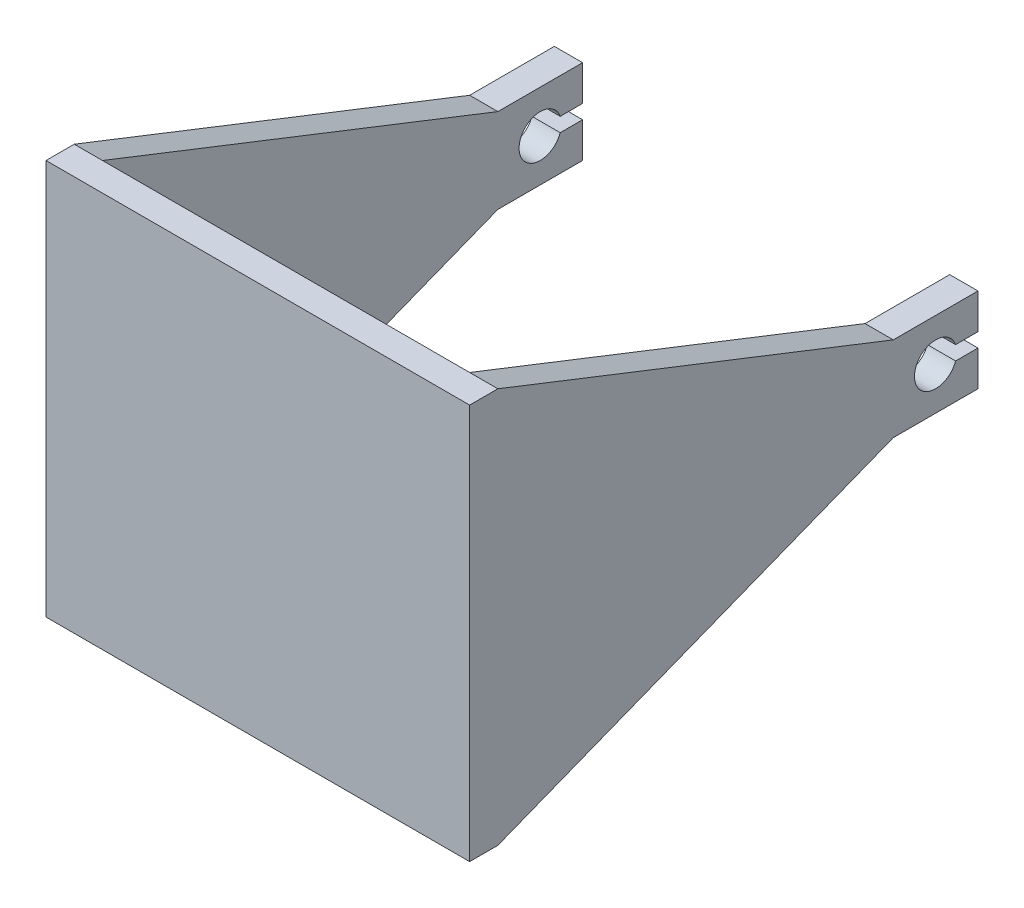
ISO-10303-21;
HEADER;
FILE_DESCRIPTION(('STEP AP214'),'2;1');
FILE_NAME('part.step','',(''),(''),'','','');
FILE_SCHEMA(('AUTOMOTIVE_DESIGN { 1 0 10303 214 1 1 1 1 }'));
ENDSEC;
DATA;
#1=APPLICATION_CONTEXT('core data for automotive mechanical design processes');
#2=APPLICATION_PROTOCOL_DEFINITION('international standard','automotive_design',2000,#1);
#3=PRODUCT_CONTEXT('',#1,'mechanical');
#4=PRODUCT('Part','Part','',(#3));
#5=PRODUCT_RELATED_PRODUCT_CATEGORY('part','',(#4));
#6=PRODUCT_DEFINITION_FORMATION('','',#4);
#7=PRODUCT_DEFINITION_CONTEXT('part definition',#1,'design');
#8=PRODUCT_DEFINITION('design','',#6,#7);
#9=PRODUCT_DEFINITION_SHAPE('','',#8);
#10=(LENGTH_UNIT() NAMED_UNIT(*) SI_UNIT(.MILLI.,.METRE.));
#11=(NAMED_UNIT(*) PLANE_ANGLE_UNIT() SI_UNIT($,.RADIAN.));
#12=(NAMED_UNIT(*) SI_UNIT($,.STERADIAN.) SOLID_ANGLE_UNIT());
#13=UNCERTAINTY_MEASURE_WITH_UNIT(LENGTH_MEASURE(1.E-05),#10,'distance_accuracy_value','');
#14=(GEOMETRIC_REPRESENTATION_CONTEXT(3) GLOBAL_UNCERTAINTY_ASSIGNED_CONTEXT((#13)) GLOBAL_UNIT_ASSIGNED_CONTEXT((#10,
#11,#12)) REPRESENTATION_CONTEXT('',''));
#15=CARTESIAN_POINT('',(0.,0.,0.));
#16=DIRECTION('',(0.,0.,1.));
#17=DIRECTION('',(1.,0.,0.));
#18=AXIS2_PLACEMENT_3D('',#15,#16,#17);
#19=CARTESIAN_POINT('',(0.,0.,150.));
#20=DIRECTION('',(0.,0.,1.));
#21=DIRECTION('',(1.,0.,0.));
#22=AXIS2_PLACEMENT_3D('',#19,#20,#21);
#23=PLANE('',#22);
#24=DIRECTION('',(-1.,0.,0.));
#25=VECTOR('',#24,1.);
#26=CARTESIAN_POINT('',(75.,70.,150.));
#27=LINE('',#26,#25);
#28=CARTESIAN_POINT('',(75.,70.,150.));
#29=VERTEX_POINT('',#28);
#30=CARTESIAN_POINT('',(-75.,70.,150.));
#31=VERTEX_POINT('',#30);
#32=EDGE_CURVE('E125',#29,#31,#27,.T.);
#33=ORIENTED_EDGE('',*,*,#32,.T.);
#34=DIRECTION('',(0.,1.,0.));
#35=VECTOR('',#34,1.);
#36=CARTESIAN_POINT('',(-75.,-70.,150.));
#37=LINE('',#36,#35);
#38=CARTESIAN_POINT('',(-75.,-70.,150.));
#39=VERTEX_POINT('',#38);
#40=EDGE_CURVE('E135',#39,#31,#37,.T.);
#41=ORIENTED_EDGE('',*,*,#40,.F.);
#42=DIRECTION('',(1.,0.,0.));
#43=VECTOR('',#42,1.);
#44=CARTESIAN_POINT('',(75.,-70.,150.));
#45=LINE('',#44,#43);
#46=CARTESIAN_POINT('',(75.,-70.,150.));
#47=VERTEX_POINT('',#46);
#48=EDGE_CURVE('E129',#39,#47,#45,.T.);
#49=ORIENTED_EDGE('',*,*,#48,.T.);
#50=DIRECTION('',(0.,1.,0.));
#51=VECTOR('',#50,1.);
#52=CARTESIAN_POINT('',(75.,-70.,150.));
#53=LINE('',#52,#51);
#54=EDGE_CURVE('E128',#47,#29,#53,.T.);
#55=ORIENTED_EDGE('',*,*,#54,.T.);
#56=EDGE_LOOP('',(#33,#41,#49,#55));
#57=FACE_BOUND('',#56,.T.);
#58=ADVANCED_FACE('F41',(#57),#23,.T.);
#59=CARTESIAN_POINT('',(75.,-70.,150.));
#60=DIRECTION('',(0.,1.,0.));
#61=DIRECTION('',(0.,0.,1.));
#62=AXIS2_PLACEMENT_3D('',#59,#60,#61);
#63=PLANE('',#62);
#64=DIRECTION('',(0.,0.,1.));
#65=VECTOR('',#64,1.);
#66=CARTESIAN_POINT('',(-75.,-70.,150.));
#67=LINE('',#66,#65);
#68=CARTESIAN_POINT('',(-75.,-70.,140.));
#69=VERTEX_POINT('',#68);
#70=EDGE_CURVE('E44',#69,#39,#67,.T.);
#71=ORIENTED_EDGE('',*,*,#70,.F.);
#72=DIRECTION('',(-1.,0.,0.));
#73=VECTOR('',#72,1.);
#74=CARTESIAN_POINT('',(225.416089564913,-70.,140.));
#75=LINE('',#74,#73);
#76=CARTESIAN_POINT('',(-65.,-70.,140.));
#77=VERTEX_POINT('',#76);
#78=EDGE_CURVE('E323',#77,#69,#75,.T.);
#79=ORIENTED_EDGE('',*,*,#78,.F.);
#80=DIRECTION('',(-1.,0.,0.));
#81=VECTOR('',#80,1.);
#82=CARTESIAN_POINT('',(215.356688476182,-70.,140.));
#83=LINE('',#82,#81);
#84=CARTESIAN_POINT('',(65.,-70.,140.));
#85=VERTEX_POINT('',#84);
#86=EDGE_CURVE('E141',#85,#77,#83,.T.);
#87=ORIENTED_EDGE('',*,*,#86,.F.);
#88=CARTESIAN_POINT('',(75.,-70.,140.));
#89=VERTEX_POINT('',#88);
#90=EDGE_CURVE('E326',#89,#85,#75,.T.);
#91=ORIENTED_EDGE('',*,*,#90,.F.);
#92=DIRECTION('',(0.,0.,-1.));
#93=VECTOR('',#92,1.);
#94=CARTESIAN_POINT('',(75.,-70.,150.));
#95=LINE('',#94,#93);
#96=EDGE_CURVE('E118',#47,#89,#95,.T.);
#97=ORIENTED_EDGE('',*,*,#96,.F.);
#98=ORIENTED_EDGE('',*,*,#48,.F.);
#99=EDGE_LOOP('',(#71,#79,#87,#91,#97,#98));
#100=FACE_BOUND('',#99,.T.);
#101=ADVANCED_FACE('F359',(#100),#63,.F.);
#102=CARTESIAN_POINT('',(75.,70.,150.));
#103=DIRECTION('',(0.,-1.,0.));
#104=DIRECTION('',(1.,0.,0.));
#105=AXIS2_PLACEMENT_3D('',#102,#103,#104);
#106=PLANE('',#105);
#107=DIRECTION('',(0.,0.,-1.));
#108=VECTOR('',#107,1.);
#109=CARTESIAN_POINT('',(75.,70.,150.));
#110=LINE('',#109,#108);
#111=CARTESIAN_POINT('',(75.,70.,140.));
#112=VERTEX_POINT('',#111);
#113=EDGE_CURVE('E115',#29,#112,#110,.T.);
#114=ORIENTED_EDGE('',*,*,#113,.T.);
#115=DIRECTION('',(-1.,0.,0.));
#116=VECTOR('',#115,1.);
#117=CARTESIAN_POINT('',(225.416089564913,70.,140.));
#118=LINE('',#117,#116);
#119=CARTESIAN_POINT('',(65.,70.,140.));
#120=VERTEX_POINT('',#119);
#121=EDGE_CURVE('E334',#112,#120,#118,.T.);
#122=ORIENTED_EDGE('',*,*,#121,.T.);
#123=DIRECTION('',(-1.,0.,0.));
#124=VECTOR('',#123,1.);
#125=CARTESIAN_POINT('',(215.356688476182,70.,140.));
#126=LINE('',#125,#124);
#127=CARTESIAN_POINT('',(-65.,70.,140.));
#128=VERTEX_POINT('',#127);
#129=EDGE_CURVE('E144',#120,#128,#126,.T.);
#130=ORIENTED_EDGE('',*,*,#129,.T.);
#131=CARTESIAN_POINT('',(-75.,70.,140.));
#132=VERTEX_POINT('',#131);
#133=EDGE_CURVE('E336',#128,#132,#118,.T.);
#134=ORIENTED_EDGE('',*,*,#133,.T.);
#135=DIRECTION('',(0.,0.,-1.));
#136=VECTOR('',#135,1.);
#137=CARTESIAN_POINT('',(-75.,70.,150.));
#138=LINE('',#137,#136);
#139=EDGE_CURVE('E132',#31,#132,#138,.T.);
#140=ORIENTED_EDGE('',*,*,#139,.F.);
#141=ORIENTED_EDGE('',*,*,#32,.F.);
#142=EDGE_LOOP('',(#114,#122,#130,#134,#140,#141));
#143=FACE_BOUND('',#142,.T.);
#144=ADVANCED_FACE('F370',(#143),#106,.F.);
#145=CARTESIAN_POINT('',(65.,-60.,150.));
#146=DIRECTION('',(-1.,0.,0.));
#147=DIRECTION('',(0.,0.,1.));
#148=AXIS2_PLACEMENT_3D('',#145,#146,#147);
#149=PLANE('',#148);
#150=DIRECTION('',(0.,0.365652372422994,-0.930751493440347));
#151=VECTOR('',#150,1.);
#152=CARTESIAN_POINT('',(65.,-72.0662983425414,145.259668508287));
#153=LINE('',#152,#151);
#154=CARTESIAN_POINT('',(65.,-15.,0.));
#155=VERTEX_POINT('',#154);
#156=EDGE_CURVE('E348',#85,#155,#153,.T.);
#157=ORIENTED_EDGE('',*,*,#156,.F.);
#158=DIRECTION('',(0.,-1.,0.));
#159=VECTOR('',#158,1.);
#160=CARTESIAN_POINT('',(65.,-60.,140.));
#161=LINE('',#160,#159);
#162=EDGE_CURVE('E131',#120,#85,#161,.T.);
#163=ORIENTED_EDGE('',*,*,#162,.F.);
#164=DIRECTION('',(0.,0.365652372422994,0.930751493440347));
#165=VECTOR('',#164,1.);
#166=CARTESIAN_POINT('',(65.,56.0220994475138,104.419889502762));
#167=LINE('',#166,#165);
#168=CARTESIAN_POINT('',(65.,15.,0.));
#169=VERTEX_POINT('',#168);
#170=EDGE_CURVE('E309',#169,#120,#167,.T.);
#171=ORIENTED_EDGE('',*,*,#170,.F.);
#172=DIRECTION('',(0.,0.,-1.));
#173=VECTOR('',#172,1.);
#174=CARTESIAN_POINT('',(65.,15.,0.));
#175=LINE('',#174,#173);
#176=CARTESIAN_POINT('',(65.,15.,-30.));
#177=VERTEX_POINT('',#176);
#178=EDGE_CURVE('E149',#169,#177,#175,.T.);
#179=ORIENTED_EDGE('',*,*,#178,.T.);
#180=DIRECTION('',(0.,-1.,0.));
#181=VECTOR('',#180,1.);
#182=CARTESIAN_POINT('',(65.,0.,-30.));
#183=LINE('',#182,#181);
#184=CARTESIAN_POINT('',(65.,2.5,-30.));
#185=VERTEX_POINT('',#184);
#186=EDGE_CURVE('E169',#177,#185,#183,.T.);
#187=ORIENTED_EDGE('',*,*,#186,.T.);
#188=DIRECTION('',(0.,0.,-1.));
#189=VECTOR('',#188,1.);
#190=CARTESIAN_POINT('',(65.,2.5,0.));
#191=LINE('',#190,#189);
#192=CARTESIAN_POINT('',(65.,2.5,-22.0710678118655));
#193=VERTEX_POINT('',#192);
#194=EDGE_CURVE('E157',#193,#185,#191,.T.);
#195=ORIENTED_EDGE('',*,*,#194,.F.);
#196=CARTESIAN_POINT('',(65.,0.,-15.));
#197=DIRECTION('',(-1.,0.,0.));
#198=DIRECTION('',(0.,0.,1.));
#199=AXIS2_PLACEMENT_3D('',#196,#197,#198);
#200=CIRCLE('',#199,7.5);
#201=CARTESIAN_POINT('',(65.,-2.5,-22.0710678118655));
#202=VERTEX_POINT('',#201);
#203=EDGE_CURVE('E172',#193,#202,#200,.F.);
#204=ORIENTED_EDGE('',*,*,#203,.T.);
#205=DIRECTION('',(0.,0.,1.));
#206=VECTOR('',#205,1.);
#207=CARTESIAN_POINT('',(65.,-2.5,0.));
#208=LINE('',#207,#206);
#209=CARTESIAN_POINT('',(65.,-2.5,-30.));
#210=VERTEX_POINT('',#209);
#211=EDGE_CURVE('E109',#210,#202,#208,.T.);
#212=ORIENTED_EDGE('',*,*,#211,.F.);
#213=DIRECTION('',(0.,-1.,0.));
#214=VECTOR('',#213,1.);
#215=CARTESIAN_POINT('',(65.,0.,-30.));
#216=LINE('',#215,#214);
#217=CARTESIAN_POINT('',(65.,-15.,-30.));
#218=VERTEX_POINT('',#217);
#219=EDGE_CURVE('E96',#210,#218,#216,.T.);
#220=ORIENTED_EDGE('',*,*,#219,.T.);
#221=DIRECTION('',(0.,0.,1.));
#222=VECTOR('',#221,1.);
#223=CARTESIAN_POINT('',(65.,-15.,0.));
#224=LINE('',#223,#222);
#225=EDGE_CURVE('E175',#218,#155,#224,.T.);
#226=ORIENTED_EDGE('',*,*,#225,.T.);
#227=EDGE_LOOP('',(#157,#163,#171,#179,#187,#195,#204,#212,#220,#226));
#228=FACE_BOUND('',#227,.T.);
#229=ADVANCED_FACE('F288',(#228),#149,.T.);
#230=CARTESIAN_POINT('',(75.,-70.,150.));
#231=DIRECTION('',(-1.,0.,0.));
#232=DIRECTION('',(0.,0.,1.));
#233=AXIS2_PLACEMENT_3D('',#230,#231,#232);
#234=PLANE('',#233);
#235=ORIENTED_EDGE('',*,*,#96,.T.);
#236=DIRECTION('',(0.,-0.365652372422994,0.930751493440347));
#237=VECTOR('',#236,1.);
#238=CARTESIAN_POINT('',(75.,-15.,0.));
#239=LINE('',#238,#237);
#240=CARTESIAN_POINT('',(75.,-15.,0.));
#241=VERTEX_POINT('',#240);
#242=EDGE_CURVE('E342',#241,#89,#239,.T.);
#243=ORIENTED_EDGE('',*,*,#242,.F.);
#244=DIRECTION('',(0.,0.,1.));
#245=VECTOR('',#244,1.);
#246=CARTESIAN_POINT('',(75.,-15.,0.));
#247=LINE('',#246,#245);
#248=CARTESIAN_POINT('',(75.,-15.,-30.));
#249=VERTEX_POINT('',#248);
#250=EDGE_CURVE('E100',#249,#241,#247,.T.);
#251=ORIENTED_EDGE('',*,*,#250,.F.);
#252=DIRECTION('',(0.,-1.,0.));
#253=VECTOR('',#252,1.);
#254=CARTESIAN_POINT('',(75.,0.,-30.));
#255=LINE('',#254,#253);
#256=CARTESIAN_POINT('',(75.,-2.5,-30.));
#257=VERTEX_POINT('',#256);
#258=EDGE_CURVE('E92',#257,#249,#255,.T.);
#259=ORIENTED_EDGE('',*,*,#258,.F.);
#260=DIRECTION('',(0.,0.,1.));
#261=VECTOR('',#260,1.);
#262=CARTESIAN_POINT('',(75.,-2.5,0.));
#263=LINE('',#262,#261);
#264=CARTESIAN_POINT('',(75.,-2.5,-22.0710678118655));
#265=VERTEX_POINT('',#264);
#266=EDGE_CURVE('E106',#257,#265,#263,.T.);
#267=ORIENTED_EDGE('',*,*,#266,.T.);
#268=CARTESIAN_POINT('',(75.,0.,-15.));
#269=DIRECTION('',(1.,0.,0.));
#270=DIRECTION('',(0.,1.,0.));
#271=AXIS2_PLACEMENT_3D('',#268,#269,#270);
#272=CIRCLE('',#271,7.5);
#273=CARTESIAN_POINT('',(75.,2.5,-22.0710678118655));
#274=VERTEX_POINT('',#273);
#275=EDGE_CURVE('E51',#274,#265,#272,.T.);
#276=ORIENTED_EDGE('',*,*,#275,.F.);
#277=DIRECTION('',(0.,0.,-1.));
#278=VECTOR('',#277,1.);
#279=CARTESIAN_POINT('',(75.,2.5,0.));
#280=LINE('',#279,#278);
#281=CARTESIAN_POINT('',(75.,2.5,-30.));
#282=VERTEX_POINT('',#281);
#283=EDGE_CURVE('E114',#274,#282,#280,.T.);
#284=ORIENTED_EDGE('',*,*,#283,.T.);
#285=DIRECTION('',(0.,-1.,0.));
#286=VECTOR('',#285,1.);
#287=CARTESIAN_POINT('',(75.,0.,-30.));
#288=LINE('',#287,#286);
#289=CARTESIAN_POINT('',(75.,15.,-30.));
#290=VERTEX_POINT('',#289);
#291=EDGE_CURVE('E159',#290,#282,#288,.T.);
#292=ORIENTED_EDGE('',*,*,#291,.F.);
#293=DIRECTION('',(0.,0.,-1.));
#294=VECTOR('',#293,1.);
#295=CARTESIAN_POINT('',(75.,15.,0.));
#296=LINE('',#295,#294);
#297=CARTESIAN_POINT('',(75.,15.,0.));
#298=VERTEX_POINT('',#297);
#299=EDGE_CURVE('E163',#298,#290,#296,.T.);
#300=ORIENTED_EDGE('',*,*,#299,.F.);
#301=DIRECTION('',(0.,-0.365652372422994,-0.930751493440347));
#302=VECTOR('',#301,1.);
#303=CARTESIAN_POINT('',(75.,70.,140.));
#304=LINE('',#303,#302);
#305=EDGE_CURVE('E302',#112,#298,#304,.T.);
#306=ORIENTED_EDGE('',*,*,#305,.F.);
#307=ORIENTED_EDGE('',*,*,#113,.F.);
#308=ORIENTED_EDGE('',*,*,#54,.F.);
#309=EDGE_LOOP('',(#235,#243,#251,#259,#267,#276,#284,#292,#300,#306,#307,#308));
#310=FACE_BOUND('',#309,.T.);
#311=ADVANCED_FACE('F105',(#310),#234,.F.);
#312=CARTESIAN_POINT('',(22.5735931288072,2.49999999999999,0.));
#313=DIRECTION('',(0.,-1.,0.));
#314=DIRECTION('',(1.,0.,0.));
#315=AXIS2_PLACEMENT_3D('',#312,#313,#314);
#316=PLANE('',#315);
#317=DIRECTION('',(1.,0.,0.));
#318=VECTOR('',#317,1.);
#319=CARTESIAN_POINT('',(22.5735931288072,2.49999999999999,-22.0710678118655));
#320=LINE('',#319,#318);
#321=EDGE_CURVE('E60',#193,#274,#320,.T.);
#322=ORIENTED_EDGE('',*,*,#321,.F.);
#323=ORIENTED_EDGE('',*,*,#194,.T.);
#324=DIRECTION('',(1.,0.,0.));
#325=VECTOR('',#324,1.);
#326=CARTESIAN_POINT('',(22.5735931288072,2.49999999999999,-30.));
#327=LINE('',#326,#325);
#328=EDGE_CURVE('E154',#185,#282,#327,.T.);
#329=ORIENTED_EDGE('',*,*,#328,.T.);
#330=ORIENTED_EDGE('',*,*,#283,.F.);
#331=EDGE_LOOP('',(#322,#323,#329,#330));
#332=FACE_BOUND('',#331,.T.);
#333=ADVANCED_FACE('F293',(#332),#316,.T.);
#334=CARTESIAN_POINT('',(22.5735931288072,0.,-30.));
#335=DIRECTION('',(0.,0.,1.));
#336=DIRECTION('',(0.,-1.,0.));
#337=AXIS2_PLACEMENT_3D('',#334,#335,#336);
#338=PLANE('',#337);
#339=ORIENTED_EDGE('',*,*,#186,.F.);
#340=DIRECTION('',(1.,0.,0.));
#341=VECTOR('',#340,1.);
#342=CARTESIAN_POINT('',(22.5735931288072,15.,-30.));
#343=LINE('',#342,#341);
#344=EDGE_CURVE('E156',#177,#290,#343,.T.);
#345=ORIENTED_EDGE('',*,*,#344,.T.);
#346=ORIENTED_EDGE('',*,*,#291,.T.);
#347=ORIENTED_EDGE('',*,*,#328,.F.);
#348=EDGE_LOOP('',(#339,#345,#346,#347));
#349=FACE_BOUND('',#348,.T.);
#350=ADVANCED_FACE('F297',(#349),#338,.F.);
#351=CARTESIAN_POINT('',(22.5735931288072,15.,0.));
#352=DIRECTION('',(0.,-1.,0.));
#353=DIRECTION('',(1.,0.,0.));
#354=AXIS2_PLACEMENT_3D('',#351,#352,#353);
#355=PLANE('',#354);
#356=ORIENTED_EDGE('',*,*,#178,.F.);
#357=DIRECTION('',(1.,0.,0.));
#358=VECTOR('',#357,1.);
#359=CARTESIAN_POINT('',(22.5735931288072,15.,0.));
#360=LINE('',#359,#358);
#361=EDGE_CURVE('E160',#169,#298,#360,.T.);
#362=ORIENTED_EDGE('',*,*,#361,.T.);
#363=ORIENTED_EDGE('',*,*,#299,.T.);
#364=ORIENTED_EDGE('',*,*,#344,.F.);
#365=EDGE_LOOP('',(#356,#362,#363,#364));
#366=FACE_BOUND('',#365,.T.);
#367=ADVANCED_FACE('F305',(#366),#355,.F.);
#368=CARTESIAN_POINT('',(22.5735931288072,-15.,0.));
#369=DIRECTION('',(0.,1.,0.));
#370=DIRECTION('',(0.,0.,1.));
#371=AXIS2_PLACEMENT_3D('',#368,#369,#370);
#372=PLANE('',#371);
#373=ORIENTED_EDGE('',*,*,#225,.F.);
#374=DIRECTION('',(1.,0.,0.));
#375=VECTOR('',#374,1.);
#376=CARTESIAN_POINT('',(22.5735931288072,-15.,-30.));
#377=LINE('',#376,#375);
#378=EDGE_CURVE('E166',#218,#249,#377,.T.);
#379=ORIENTED_EDGE('',*,*,#378,.T.);
#380=ORIENTED_EDGE('',*,*,#250,.T.);
#381=DIRECTION('',(1.,0.,0.));
#382=VECTOR('',#381,1.);
#383=CARTESIAN_POINT('',(22.5735931288072,-15.,0.));
#384=LINE('',#383,#382);
#385=EDGE_CURVE('E121',#155,#241,#384,.T.);
#386=ORIENTED_EDGE('',*,*,#385,.F.);
#387=EDGE_LOOP('',(#373,#379,#380,#386));
#388=FACE_BOUND('',#387,.T.);
#389=ADVANCED_FACE('F192',(#388),#372,.F.);
#390=CARTESIAN_POINT('',(22.5735931288072,0.,-30.));
#391=DIRECTION('',(0.,0.,1.));
#392=DIRECTION('',(0.,-1.,0.));
#393=AXIS2_PLACEMENT_3D('',#390,#391,#392);
#394=PLANE('',#393);
#395=ORIENTED_EDGE('',*,*,#219,.F.);
#396=DIRECTION('',(1.,0.,0.));
#397=VECTOR('',#396,1.);
#398=CARTESIAN_POINT('',(22.5735931288072,-2.50000000000001,-30.));
#399=LINE('',#398,#397);
#400=EDGE_CURVE('E88',#210,#257,#399,.T.);
#401=ORIENTED_EDGE('',*,*,#400,.T.);
#402=ORIENTED_EDGE('',*,*,#258,.T.);
#403=ORIENTED_EDGE('',*,*,#378,.F.);
#404=EDGE_LOOP('',(#395,#401,#402,#403));
#405=FACE_BOUND('',#404,.T.);
#406=ADVANCED_FACE('F90',(#405),#394,.F.);
#407=CARTESIAN_POINT('',(22.5735931288072,-2.50000000000001,0.));
#408=DIRECTION('',(0.,1.,0.));
#409=DIRECTION('',(0.,0.,1.));
#410=AXIS2_PLACEMENT_3D('',#407,#408,#409);
#411=PLANE('',#410);
#412=ORIENTED_EDGE('',*,*,#400,.F.);
#413=ORIENTED_EDGE('',*,*,#211,.T.);
#414=DIRECTION('',(1.,0.,0.));
#415=VECTOR('',#414,1.);
#416=CARTESIAN_POINT('',(22.5735931288072,-2.50000000000001,-22.0710678118655));
#417=LINE('',#416,#415);
#418=EDGE_CURVE('E113',#202,#265,#417,.T.);
#419=ORIENTED_EDGE('',*,*,#418,.T.);
#420=ORIENTED_EDGE('',*,*,#266,.F.);
#421=EDGE_LOOP('',(#412,#413,#419,#420));
#422=FACE_BOUND('',#421,.T.);
#423=ADVANCED_FACE('F111',(#422),#411,.T.);
#424=CARTESIAN_POINT('',(22.5735931288072,0.,-15.));
#425=DIRECTION('',(1.,0.,0.));
#426=DIRECTION('',(0.,1.,0.));
#427=AXIS2_PLACEMENT_3D('',#424,#425,#426);
#428=CYLINDRICAL_SURFACE('',#427,7.5);
#429=ORIENTED_EDGE('',*,*,#203,.F.);
#430=ORIENTED_EDGE('',*,*,#321,.T.);
#431=ORIENTED_EDGE('',*,*,#275,.T.);
#432=ORIENTED_EDGE('',*,*,#418,.F.);
#433=EDGE_LOOP('',(#429,#430,#431,#432));
#434=FACE_BOUND('',#433,.T.);
#435=ADVANCED_FACE('F289',(#434),#428,.F.);
#436=CARTESIAN_POINT('',(215.356688476182,-70.,140.));
#437=DIRECTION('',(0.,0.,-1.));
#438=DIRECTION('',(-1.,0.,0.));
#439=AXIS2_PLACEMENT_3D('',#436,#437,#438);
#440=PLANE('',#439);
#441=DIRECTION('',(0.,-1.,0.));
#442=VECTOR('',#441,1.);
#443=CARTESIAN_POINT('',(-65.,-70.,140.));
#444=LINE('',#443,#442);
#445=EDGE_CURVE('E11',#128,#77,#444,.T.);
#446=ORIENTED_EDGE('',*,*,#445,.F.);
#447=ORIENTED_EDGE('',*,*,#129,.F.);
#448=ORIENTED_EDGE('',*,*,#162,.T.);
#449=ORIENTED_EDGE('',*,*,#86,.T.);
#450=EDGE_LOOP('',(#446,#447,#448,#449));
#451=FACE_BOUND('',#450,.T.);
#452=ADVANCED_FACE('F356',(#451),#440,.T.);
#453=CARTESIAN_POINT('',(-75.,0.,0.));
#454=DIRECTION('',(-1.,0.,0.));
#455=DIRECTION('',(0.,0.,1.));
#456=AXIS2_PLACEMENT_3D('',#453,#454,#455);
#457=PLANE('',#456);
#458=DIRECTION('',(0.,0.365652372422994,-0.930751493440347));
#459=VECTOR('',#458,1.);
#460=CARTESIAN_POINT('',(-75.,-12.9944751381215,-5.10497237569061));
#461=LINE('',#460,#459);
#462=CARTESIAN_POINT('',(-75.,-15.,0.));
#463=VERTEX_POINT('',#462);
#464=EDGE_CURVE('E316',#69,#463,#461,.T.);
#465=ORIENTED_EDGE('',*,*,#464,.F.);
#466=ORIENTED_EDGE('',*,*,#70,.T.);
#467=ORIENTED_EDGE('',*,*,#40,.T.);
#468=ORIENTED_EDGE('',*,*,#139,.T.);
#469=DIRECTION('',(0.,0.365652372422994,0.930751493440347));
#470=VECTOR('',#469,1.);
#471=CARTESIAN_POINT('',(-75.,12.9944751381215,-5.10497237569061));
#472=LINE('',#471,#470);
#473=CARTESIAN_POINT('',(-75.,15.,0.));
#474=VERTEX_POINT('',#473);
#475=EDGE_CURVE('E314',#474,#132,#472,.T.);
#476=ORIENTED_EDGE('',*,*,#475,.F.);
#477=DIRECTION('',(0.,0.,-1.));
#478=VECTOR('',#477,1.);
#479=CARTESIAN_POINT('',(-75.,15.,0.));
#480=LINE('',#479,#478);
#481=CARTESIAN_POINT('',(-75.,15.,-30.));
#482=VERTEX_POINT('',#481);
#483=EDGE_CURVE('E441',#474,#482,#480,.T.);
#484=ORIENTED_EDGE('',*,*,#483,.T.);
#485=DIRECTION('',(0.,-1.,0.));
#486=VECTOR('',#485,1.);
#487=CARTESIAN_POINT('',(-75.,0.,-30.));
#488=LINE('',#487,#486);
#489=CARTESIAN_POINT('',(-75.,2.5,-30.));
#490=VERTEX_POINT('',#489);
#491=EDGE_CURVE('E392',#482,#490,#488,.T.);
#492=ORIENTED_EDGE('',*,*,#491,.T.);
#493=DIRECTION('',(0.,0.,-1.));
#494=VECTOR('',#493,1.);
#495=CARTESIAN_POINT('',(-75.,2.5,0.));
#496=LINE('',#495,#494);
#497=CARTESIAN_POINT('',(-75.,2.5,-22.0710678118655));
#498=VERTEX_POINT('',#497);
#499=EDGE_CURVE('E395',#498,#490,#496,.T.);
#500=ORIENTED_EDGE('',*,*,#499,.F.);
#501=CARTESIAN_POINT('',(-75.,0.,-15.));
#502=DIRECTION('',(-1.,0.,0.));
#503=DIRECTION('',(0.,0.,1.));
#504=AXIS2_PLACEMENT_3D('',#501,#502,#503);
#505=CIRCLE('',#504,7.5);
#506=CARTESIAN_POINT('',(-75.,-2.5,-22.0710678118655));
#507=VERTEX_POINT('',#506);
#508=EDGE_CURVE('E396',#507,#498,#505,.T.);
#509=ORIENTED_EDGE('',*,*,#508,.F.);
#510=DIRECTION('',(0.,0.,1.));
#511=VECTOR('',#510,1.);
#512=CARTESIAN_POINT('',(-75.,-2.5,0.));
#513=LINE('',#512,#511);
#514=CARTESIAN_POINT('',(-75.,-2.5,-30.));
#515=VERTEX_POINT('',#514);
#516=EDGE_CURVE('E412',#515,#507,#513,.T.);
#517=ORIENTED_EDGE('',*,*,#516,.F.);
#518=DIRECTION('',(0.,-1.,0.));
#519=VECTOR('',#518,1.);
#520=CARTESIAN_POINT('',(-75.,0.,-30.));
#521=LINE('',#520,#519);
#522=CARTESIAN_POINT('',(-75.,-15.,-30.));
#523=VERTEX_POINT('',#522);
#524=EDGE_CURVE('E445',#515,#523,#521,.T.);
#525=ORIENTED_EDGE('',*,*,#524,.T.);
#526=DIRECTION('',(0.,0.,1.));
#527=VECTOR('',#526,1.);
#528=CARTESIAN_POINT('',(-75.,-15.,0.));
#529=LINE('',#528,#527);
#530=EDGE_CURVE('E443',#523,#463,#529,.T.);
#531=ORIENTED_EDGE('',*,*,#530,.T.);
#532=EDGE_LOOP('',(#465,#466,#467,#468,#476,#484,#492,#500,#509,#517,#525,#531));
#533=FACE_BOUND('',#532,.T.);
#534=ADVANCED_FACE('F452',(#533),#457,.T.);
#535=CARTESIAN_POINT('',(-22.5735931288071,0.,-30.));
#536=DIRECTION('',(0.,0.,-1.));
#537=DIRECTION('',(0.,1.,0.));
#538=AXIS2_PLACEMENT_3D('',#535,#536,#537);
#539=PLANE('',#538);
#540=DIRECTION('',(-1.,0.,0.));
#541=VECTOR('',#540,1.);
#542=CARTESIAN_POINT('',(-22.5735931288071,15.,-30.));
#543=LINE('',#542,#541);
#544=CARTESIAN_POINT('',(-65.,15.,-30.));
#545=VERTEX_POINT('',#544);
#546=EDGE_CURVE('E400',#545,#482,#543,.T.);
#547=ORIENTED_EDGE('',*,*,#546,.F.);
#548=DIRECTION('',(0.,-1.,0.));
#549=VECTOR('',#548,1.);
#550=CARTESIAN_POINT('',(-65.,0.,-30.));
#551=LINE('',#550,#549);
#552=CARTESIAN_POINT('',(-65.,2.5,-30.));
#553=VERTEX_POINT('',#552);
#554=EDGE_CURVE('E387',#545,#553,#551,.T.);
#555=ORIENTED_EDGE('',*,*,#554,.T.);
#556=DIRECTION('',(-1.,0.,0.));
#557=VECTOR('',#556,1.);
#558=CARTESIAN_POINT('',(-22.5735931288071,2.5,-30.));
#559=LINE('',#558,#557);
#560=EDGE_CURVE('E397',#553,#490,#559,.T.);
#561=ORIENTED_EDGE('',*,*,#560,.T.);
#562=ORIENTED_EDGE('',*,*,#491,.F.);
#563=EDGE_LOOP('',(#547,#555,#561,#562));
#564=FACE_BOUND('',#563,.T.);
#565=ADVANCED_FACE('F430',(#564),#539,.T.);
#566=CARTESIAN_POINT('',(-22.5735931288071,2.5,0.));
#567=DIRECTION('',(0.,1.,0.));
#568=DIRECTION('',(0.,0.,1.));
#569=AXIS2_PLACEMENT_3D('',#566,#567,#568);
#570=PLANE('',#569);
#571=DIRECTION('',(0.,0.,-1.));
#572=VECTOR('',#571,1.);
#573=CARTESIAN_POINT('',(-65.,2.5,0.));
#574=LINE('',#573,#572);
#575=CARTESIAN_POINT('',(-65.,2.5,-22.0710678118655));
#576=VERTEX_POINT('',#575);
#577=EDGE_CURVE('E378',#576,#553,#574,.T.);
#578=ORIENTED_EDGE('',*,*,#577,.F.);
#579=DIRECTION('',(-1.,0.,0.));
#580=VECTOR('',#579,1.);
#581=CARTESIAN_POINT('',(-22.5735931288071,2.5,-22.0710678118655));
#582=LINE('',#581,#580);
#583=EDGE_CURVE('E393',#576,#498,#582,.T.);
#584=ORIENTED_EDGE('',*,*,#583,.T.);
#585=ORIENTED_EDGE('',*,*,#499,.T.);
#586=ORIENTED_EDGE('',*,*,#560,.F.);
#587=EDGE_LOOP('',(#578,#584,#585,#586));
#588=FACE_BOUND('',#587,.T.);
#589=ADVANCED_FACE('F501',(#588),#570,.F.);
#590=CARTESIAN_POINT('',(-22.5735931288071,0.,-15.));
#591=DIRECTION('',(-1.,0.,0.));
#592=DIRECTION('',(0.,0.,1.));
#593=AXIS2_PLACEMENT_3D('',#590,#591,#592);
#594=CYLINDRICAL_SURFACE('',#593,7.5);
#595=CARTESIAN_POINT('',(-65.,0.,-15.));
#596=DIRECTION('',(1.,0.,0.));
#597=DIRECTION('',(0.,0.,-1.));
#598=AXIS2_PLACEMENT_3D('',#595,#596,#597);
#599=CIRCLE('',#598,7.5);
#600=CARTESIAN_POINT('',(-65.,-2.5,-22.0710678118655));
#601=VERTEX_POINT('',#600);
#602=EDGE_CURVE('E380',#601,#576,#599,.F.);
#603=ORIENTED_EDGE('',*,*,#602,.F.);
#604=DIRECTION('',(-1.,0.,0.));
#605=VECTOR('',#604,1.);
#606=CARTESIAN_POINT('',(-22.5735931288071,-2.5,-22.0710678118655));
#607=LINE('',#606,#605);
#608=EDGE_CURVE('E352',#601,#507,#607,.T.);
#609=ORIENTED_EDGE('',*,*,#608,.T.);
#610=ORIENTED_EDGE('',*,*,#508,.T.);
#611=ORIENTED_EDGE('',*,*,#583,.F.);
#612=EDGE_LOOP('',(#603,#609,#610,#611));
#613=FACE_BOUND('',#612,.T.);
#614=ADVANCED_FACE('F498',(#613),#594,.F.);
#615=CARTESIAN_POINT('',(-22.5735931288071,-2.5,0.));
#616=DIRECTION('',(0.,-1.,0.));
#617=DIRECTION('',(0.,0.,-1.));
#618=AXIS2_PLACEMENT_3D('',#615,#616,#617);
#619=PLANE('',#618);
#620=DIRECTION('',(0.,0.,1.));
#621=VECTOR('',#620,1.);
#622=CARTESIAN_POINT('',(-65.,-2.5,0.));
#623=LINE('',#622,#621);
#624=CARTESIAN_POINT('',(-65.,-2.5,-30.));
#625=VERTEX_POINT('',#624);
#626=EDGE_CURVE('E384',#625,#601,#623,.T.);
#627=ORIENTED_EDGE('',*,*,#626,.F.);
#628=DIRECTION('',(-1.,0.,0.));
#629=VECTOR('',#628,1.);
#630=CARTESIAN_POINT('',(-22.5735931288071,-2.5,-30.));
#631=LINE('',#630,#629);
#632=EDGE_CURVE('E411',#625,#515,#631,.T.);
#633=ORIENTED_EDGE('',*,*,#632,.T.);
#634=ORIENTED_EDGE('',*,*,#516,.T.);
#635=ORIENTED_EDGE('',*,*,#608,.F.);
#636=EDGE_LOOP('',(#627,#633,#634,#635));
#637=FACE_BOUND('',#636,.T.);
#638=ADVANCED_FACE('F451',(#637),#619,.F.);
#639=CARTESIAN_POINT('',(-22.5735931288071,0.,-30.));
#640=DIRECTION('',(0.,0.,-1.));
#641=DIRECTION('',(0.,1.,0.));
#642=AXIS2_PLACEMENT_3D('',#639,#640,#641);
#643=PLANE('',#642);
#644=ORIENTED_EDGE('',*,*,#632,.F.);
#645=DIRECTION('',(0.,-1.,0.));
#646=VECTOR('',#645,1.);
#647=CARTESIAN_POINT('',(-65.,0.,-30.));
#648=LINE('',#647,#646);
#649=CARTESIAN_POINT('',(-65.,-15.,-30.));
#650=VERTEX_POINT('',#649);
#651=EDGE_CURVE('E408',#625,#650,#648,.T.);
#652=ORIENTED_EDGE('',*,*,#651,.T.);
#653=DIRECTION('',(-1.,0.,0.));
#654=VECTOR('',#653,1.);
#655=CARTESIAN_POINT('',(-22.5735931288071,-15.,-30.));
#656=LINE('',#655,#654);
#657=EDGE_CURVE('E409',#650,#523,#656,.T.);
#658=ORIENTED_EDGE('',*,*,#657,.T.);
#659=ORIENTED_EDGE('',*,*,#524,.F.);
#660=EDGE_LOOP('',(#644,#652,#658,#659));
#661=FACE_BOUND('',#660,.T.);
#662=ADVANCED_FACE('F508',(#661),#643,.T.);
#663=CARTESIAN_POINT('',(-22.5735931288071,15.,0.));
#664=DIRECTION('',(0.,1.,0.));
#665=DIRECTION('',(0.,0.,1.));
#666=AXIS2_PLACEMENT_3D('',#663,#664,#665);
#667=PLANE('',#666);
#668=DIRECTION('',(-1.,0.,0.));
#669=VECTOR('',#668,1.);
#670=CARTESIAN_POINT('',(-22.5735931288071,15.,0.));
#671=LINE('',#670,#669);
#672=CARTESIAN_POINT('',(-65.,15.,0.));
#673=VERTEX_POINT('',#672);
#674=EDGE_CURVE('E402',#673,#474,#671,.T.);
#675=ORIENTED_EDGE('',*,*,#674,.F.);
#676=DIRECTION('',(0.,0.,-1.));
#677=VECTOR('',#676,1.);
#678=CARTESIAN_POINT('',(-65.,15.,0.));
#679=LINE('',#678,#677);
#680=EDGE_CURVE('E399',#673,#545,#679,.T.);
#681=ORIENTED_EDGE('',*,*,#680,.T.);
#682=ORIENTED_EDGE('',*,*,#546,.T.);
#683=ORIENTED_EDGE('',*,*,#483,.F.);
#684=EDGE_LOOP('',(#675,#681,#682,#683));
#685=FACE_BOUND('',#684,.T.);
#686=ADVANCED_FACE('F426',(#685),#667,.T.);
#687=CARTESIAN_POINT('',(-22.5735931288071,-15.,0.));
#688=DIRECTION('',(0.,-1.,0.));
#689=DIRECTION('',(0.,0.,-1.));
#690=AXIS2_PLACEMENT_3D('',#687,#688,#689);
#691=PLANE('',#690);
#692=ORIENTED_EDGE('',*,*,#657,.F.);
#693=DIRECTION('',(0.,0.,1.));
#694=VECTOR('',#693,1.);
#695=CARTESIAN_POINT('',(-65.,-15.,0.));
#696=LINE('',#695,#694);
#697=CARTESIAN_POINT('',(-65.,-15.,0.));
#698=VERTEX_POINT('',#697);
#699=EDGE_CURVE('E404',#650,#698,#696,.T.);
#700=ORIENTED_EDGE('',*,*,#699,.T.);
#701=DIRECTION('',(-1.,0.,0.));
#702=VECTOR('',#701,1.);
#703=CARTESIAN_POINT('',(-22.5735931288071,-15.,0.));
#704=LINE('',#703,#702);
#705=EDGE_CURVE('E405',#698,#463,#704,.T.);
#706=ORIENTED_EDGE('',*,*,#705,.T.);
#707=ORIENTED_EDGE('',*,*,#530,.F.);
#708=EDGE_LOOP('',(#692,#700,#706,#707));
#709=FACE_BOUND('',#708,.T.);
#710=ADVANCED_FACE('F463',(#709),#691,.T.);
#711=CARTESIAN_POINT('',(-65.,-60.,150.));
#712=DIRECTION('',(1.,0.,0.));
#713=DIRECTION('',(0.,0.,-1.));
#714=AXIS2_PLACEMENT_3D('',#711,#712,#713);
#715=PLANE('',#714);
#716=DIRECTION('',(0.,-0.365652372422994,0.930751493440347));
#717=VECTOR('',#716,1.);
#718=CARTESIAN_POINT('',(-65.,-72.0662983425414,145.259668508287));
#719=LINE('',#718,#717);
#720=EDGE_CURVE('E313',#698,#77,#719,.T.);
#721=ORIENTED_EDGE('',*,*,#720,.F.);
#722=ORIENTED_EDGE('',*,*,#699,.F.);
#723=ORIENTED_EDGE('',*,*,#651,.F.);
#724=ORIENTED_EDGE('',*,*,#626,.T.);
#725=ORIENTED_EDGE('',*,*,#602,.T.);
#726=ORIENTED_EDGE('',*,*,#577,.T.);
#727=ORIENTED_EDGE('',*,*,#554,.F.);
#728=ORIENTED_EDGE('',*,*,#680,.F.);
#729=DIRECTION('',(0.,-0.365652372422994,-0.930751493440347));
#730=VECTOR('',#729,1.);
#731=CARTESIAN_POINT('',(-65.,56.0220994475138,104.419889502762));
#732=LINE('',#731,#730);
#733=EDGE_CURVE('E318',#128,#673,#732,.T.);
#734=ORIENTED_EDGE('',*,*,#733,.F.);
#735=ORIENTED_EDGE('',*,*,#445,.T.);
#736=EDGE_LOOP('',(#721,#722,#723,#724,#725,#726,#727,#728,#734,#735));
#737=FACE_BOUND('',#736,.T.);
#738=ADVANCED_FACE('F365',(#737),#715,.T.);
#739=CARTESIAN_POINT('',(225.416089564913,70.,140.));
#740=DIRECTION('',(0.,-0.930751493440347,0.365652372422994));
#741=DIRECTION('',(0.,-0.365652372422994,-0.930751493440347));
#742=AXIS2_PLACEMENT_3D('',#739,#740,#741);
#743=PLANE('',#742);
#744=ORIENTED_EDGE('',*,*,#475,.T.);
#745=ORIENTED_EDGE('',*,*,#133,.F.);
#746=ORIENTED_EDGE('',*,*,#733,.T.);
#747=ORIENTED_EDGE('',*,*,#674,.T.);
#748=EDGE_LOOP('',(#744,#745,#746,#747));
#749=FACE_BOUND('',#748,.T.);
#750=ADVANCED_FACE('F454',(#749),#743,.F.);
#751=CARTESIAN_POINT('',(225.416089564913,-15.,0.));
#752=DIRECTION('',(0.,0.930751493440347,0.365652372422993));
#753=DIRECTION('',(0.,-0.365652372422994,0.930751493440347));
#754=AXIS2_PLACEMENT_3D('',#751,#752,#753);
#755=PLANE('',#754);
#756=ORIENTED_EDGE('',*,*,#464,.T.);
#757=ORIENTED_EDGE('',*,*,#705,.F.);
#758=ORIENTED_EDGE('',*,*,#720,.T.);
#759=ORIENTED_EDGE('',*,*,#78,.T.);
#760=EDGE_LOOP('',(#756,#757,#758,#759));
#761=FACE_BOUND('',#760,.T.);
#762=ADVANCED_FACE('F456',(#761),#755,.F.);
#763=ORIENTED_EDGE('',*,*,#156,.T.);
#764=ORIENTED_EDGE('',*,*,#385,.T.);
#765=ORIENTED_EDGE('',*,*,#242,.T.);
#766=ORIENTED_EDGE('',*,*,#90,.T.);
#767=EDGE_LOOP('',(#763,#764,#765,#766));
#768=FACE_BOUND('',#767,.T.);
#769=ADVANCED_FACE('F347',(#768),#755,.F.);
#770=ORIENTED_EDGE('',*,*,#170,.T.);
#771=ORIENTED_EDGE('',*,*,#121,.F.);
#772=ORIENTED_EDGE('',*,*,#305,.T.);
#773=ORIENTED_EDGE('',*,*,#361,.F.);
#774=EDGE_LOOP('',(#770,#771,#772,#773));
#775=FACE_BOUND('',#774,.T.);
#776=ADVANCED_FACE('F308',(#775),#743,.F.);
#777=CLOSED_SHELL('',(#58,#101,#144,#229,#311,#333,#350,#367,#389,#406,#423,#435,#452,#534,#565,
#589,#614,#638,#662,#686,#710,#738,#750,#762,#769,#776));
#778=MANIFOLD_SOLID_BREP('B2',#777);
#779=ADVANCED_BREP_SHAPE_REPRESENTATION('',(#18,#778),#14);
#780=SHAPE_DEFINITION_REPRESENTATION(#9,#779);
ENDSEC;
END-ISO-10303-21;
